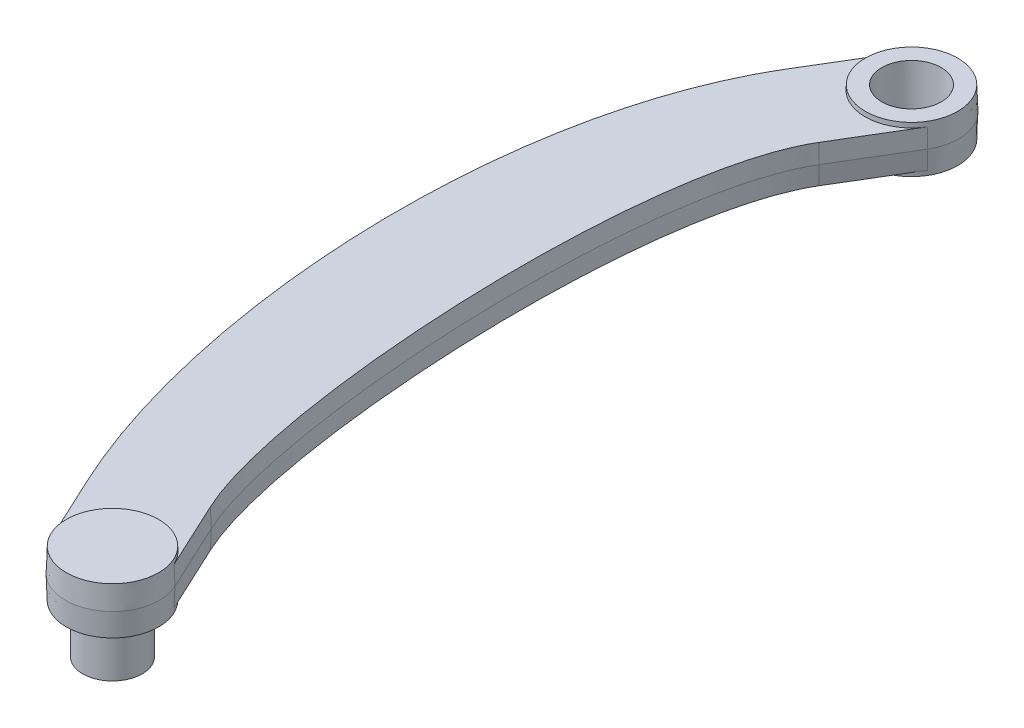
ISO-10303-21;
HEADER;
FILE_DESCRIPTION(('STEP AP214'),'2;1');
FILE_NAME('part.step','',(''),(''),'','','');
FILE_SCHEMA(('AUTOMOTIVE_DESIGN { 1 0 10303 214 1 1 1 1 }'));
ENDSEC;
DATA;
#1=APPLICATION_CONTEXT('core data for automotive mechanical design processes');
#2=APPLICATION_PROTOCOL_DEFINITION('international standard','automotive_design',2000,#1);
#3=PRODUCT_CONTEXT('',#1,'mechanical');
#4=PRODUCT('Part','Part','',(#3));
#5=PRODUCT_RELATED_PRODUCT_CATEGORY('part','',(#4));
#6=PRODUCT_DEFINITION_FORMATION('','',#4);
#7=PRODUCT_DEFINITION_CONTEXT('part definition',#1,'design');
#8=PRODUCT_DEFINITION('design','',#6,#7);
#9=PRODUCT_DEFINITION_SHAPE('','',#8);
#10=(LENGTH_UNIT() NAMED_UNIT(*) SI_UNIT(.MILLI.,.METRE.));
#11=(NAMED_UNIT(*) PLANE_ANGLE_UNIT() SI_UNIT($,.RADIAN.));
#12=(NAMED_UNIT(*) SI_UNIT($,.STERADIAN.) SOLID_ANGLE_UNIT());
#13=UNCERTAINTY_MEASURE_WITH_UNIT(LENGTH_MEASURE(1.E-05),#10,'distance_accuracy_value','');
#14=(GEOMETRIC_REPRESENTATION_CONTEXT(3) GLOBAL_UNCERTAINTY_ASSIGNED_CONTEXT((#13)) GLOBAL_UNIT_ASSIGNED_CONTEXT((#10,
#11,#12)) REPRESENTATION_CONTEXT('',''));
#15=CARTESIAN_POINT('',(0.,0.,0.));
#16=DIRECTION('',(0.,0.,1.));
#17=DIRECTION('',(1.,0.,0.));
#18=AXIS2_PLACEMENT_3D('',#15,#16,#17);
#19=CARTESIAN_POINT('',(27.4992695920869,171.,1604.79046254249));
#20=DIRECTION('',(0.,-1.,0.));
#21=DIRECTION('',(0.,0.,-1.));
#22=AXIS2_PLACEMENT_3D('',#19,#20,#21);
#23=PLANE('',#22);
#24=CARTESIAN_POINT('',(27.4992695920869,171.,1604.79046254249));
#25=DIRECTION('',(0.,1.,0.));
#26=DIRECTION('',(0.,0.,1.));
#27=AXIS2_PLACEMENT_3D('',#24,#25,#26);
#28=CIRCLE('',#27,49.1269807627063);
#29=CARTESIAN_POINT('',(27.4992695920869,171.,1653.9174433052));
#30=VERTEX_POINT('',#29);
#31=EDGE_CURVE('E52',#30,#30,#28,.T.);
#32=ORIENTED_EDGE('',*,*,#31,.F.);
#33=EDGE_LOOP('',(#32));
#34=FACE_BOUND('',#33,.T.);
#35=CARTESIAN_POINT('',(27.499269592087,171.,1604.79046254249));
#36=DIRECTION('',(0.,1.,0.));
#37=DIRECTION('',(0.,0.,-1.));
#38=AXIS2_PLACEMENT_3D('',#35,#36,#37);
#39=CIRCLE('',#38,31.620388964152);
#40=CARTESIAN_POINT('',(27.499269592087,171.,1573.17007357834));
#41=VERTEX_POINT('',#40);
#42=EDGE_CURVE('E11',#41,#41,#39,.T.);
#43=ORIENTED_EDGE('',*,*,#42,.T.);
#44=EDGE_LOOP('',(#43));
#45=FACE_BOUND('',#44,.T.);
#46=ADVANCED_FACE('F42',(#34,#45),#23,.T.);
#47=CARTESIAN_POINT('',(27.4992695920869,196.,1604.79046254249));
#48=DIRECTION('',(0.,1.,0.));
#49=DIRECTION('',(0.,0.,1.));
#50=AXIS2_PLACEMENT_3D('',#47,#48,#49);
#51=CONICAL_SURFACE('',#50,50.,0.0349065849999998);
#52=ORIENTED_EDGE('',*,*,#31,.T.);
#53=EDGE_LOOP('',(#52));
#54=FACE_BOUND('',#53,.T.);
#55=CARTESIAN_POINT('',(27.4992695920869,176.,1604.79046254249));
#56=DIRECTION('',(0.,-1.,0.));
#57=DIRECTION('',(0.,0.,-1.));
#58=AXIS2_PLACEMENT_3D('',#55,#56,#57);
#59=CIRCLE('',#58,49.3015846101651);
#60=CARTESIAN_POINT('',(-17.183140453352,176.,1625.62621253151));
#61=VERTEX_POINT('',#60);
#62=CARTESIAN_POINT('',(72.1816796375259,176.,1583.95471255349));
#63=VERTEX_POINT('',#62);
#64=EDGE_CURVE('E212',#61,#63,#59,.T.);
#65=ORIENTED_EDGE('',*,*,#64,.T.);
#66=DIRECTION('',(0.0316296856251365,0.999390827019096,-0.0147491646320362));
#67=VECTOR('',#66,1.);
#68=CARTESIAN_POINT('',(72.8146589439195,196.,1583.65954945546));
#69=LINE('',#68,#67);
#70=CARTESIAN_POINT('',(72.8146589439195,196.,1583.65954945546));
#71=VERTEX_POINT('',#70);
#72=EDGE_CURVE('E186',#63,#71,#69,.T.);
#73=ORIENTED_EDGE('',*,*,#72,.T.);
#74=CARTESIAN_POINT('',(27.4992695920869,196.,1604.79046254249));
#75=DIRECTION('',(0.,1.,0.));
#76=DIRECTION('',(-1.,0.,0.));
#77=AXIS2_PLACEMENT_3D('',#74,#75,#76);
#78=CIRCLE('',#77,50.);
#79=CARTESIAN_POINT('',(-17.8161197597457,196.,1625.92137562953));
#80=VERTEX_POINT('',#79);
#81=EDGE_CURVE('E211',#80,#71,#78,.T.);
#82=ORIENTED_EDGE('',*,*,#81,.F.);
#83=DIRECTION('',(-0.0316296856251366,0.999390827019096,0.0147491646320361));
#84=VECTOR('',#83,1.);
#85=CARTESIAN_POINT('',(-17.8161197597457,196.,1625.92137562953));
#86=LINE('',#85,#84);
#87=EDGE_CURVE('E231',#61,#80,#86,.T.);
#88=ORIENTED_EDGE('',*,*,#87,.F.);
#89=EDGE_LOOP('',(#65,#73,#82,#88));
#90=FACE_BOUND('',#89,.T.);
#91=ADVANCED_FACE('F355',(#54,#90),#51,.T.);
#92=CARTESIAN_POINT('',(27.4992695920869,196.,754.790462542496));
#93=DIRECTION('',(0.,1.,0.));
#94=DIRECTION('',(0.,0.,1.));
#95=AXIS2_PLACEMENT_3D('',#92,#93,#94);
#96=CONICAL_SURFACE('',#95,50.,0.0349065849999998);
#97=CARTESIAN_POINT('',(27.4992695920869,171.,754.790462542496));
#98=DIRECTION('',(0.,1.,0.));
#99=DIRECTION('',(0.,0.,1.));
#100=AXIS2_PLACEMENT_3D('',#97,#98,#99);
#101=CIRCLE('',#100,49.1269807627063);
#102=CARTESIAN_POINT('',(27.4992695920869,171.,803.917443305202));
#103=VERTEX_POINT('',#102);
#104=EDGE_CURVE('E218',#103,#103,#101,.T.);
#105=ORIENTED_EDGE('',*,*,#104,.T.);
#106=EDGE_LOOP('',(#105));
#107=FACE_BOUND('',#106,.T.);
#108=CARTESIAN_POINT('',(27.4992695920869,176.,754.790462542496));
#109=DIRECTION('',(0.,1.,0.));
#110=DIRECTION('',(0.,0.,-1.));
#111=AXIS2_PLACEMENT_3D('',#108,#109,#110);
#112=CIRCLE('',#111,49.3015846101651);
#113=CARTESIAN_POINT('',(-14.7276021401644,176.,729.34370344077));
#114=VERTEX_POINT('',#113);
#115=CARTESIAN_POINT('',(69.7261413243383,176.,780.237221644222));
#116=VERTEX_POINT('',#115);
#117=EDGE_CURVE('E266',#114,#116,#112,.T.);
#118=ORIENTED_EDGE('',*,*,#117,.F.);
#119=DIRECTION('',(-0.0298914645934684,0.999390827019096,-0.0180131955672863));
#120=VECTOR('',#119,1.);
#121=CARTESIAN_POINT('',(-15.3257958354703,196.,728.983219932611));
#122=LINE('',#121,#120);
#123=CARTESIAN_POINT('',(-15.3257958354703,196.,728.983219932611));
#124=VERTEX_POINT('',#123);
#125=EDGE_CURVE('E215',#114,#124,#122,.T.);
#126=ORIENTED_EDGE('',*,*,#125,.T.);
#127=CARTESIAN_POINT('',(27.4992695920869,196.,754.790462542496));
#128=DIRECTION('',(0.,1.,0.));
#129=DIRECTION('',(-1.,0.,0.));
#130=AXIS2_PLACEMENT_3D('',#127,#128,#129);
#131=CIRCLE('',#130,50.);
#132=CARTESIAN_POINT('',(70.3243350196442,196.,780.597705152381));
#133=VERTEX_POINT('',#132);
#134=EDGE_CURVE('E182',#133,#124,#131,.T.);
#135=ORIENTED_EDGE('',*,*,#134,.F.);
#136=DIRECTION('',(0.0298914645934685,0.999390827019096,0.0180131955672862));
#137=VECTOR('',#136,1.);
#138=CARTESIAN_POINT('',(70.3243350196442,196.,780.597705152381));
#139=LINE('',#138,#137);
#140=EDGE_CURVE('E206',#116,#133,#139,.T.);
#141=ORIENTED_EDGE('',*,*,#140,.F.);
#142=EDGE_LOOP('',(#118,#126,#135,#141));
#143=FACE_BOUND('',#142,.T.);
#144=ADVANCED_FACE('F360',(#107,#143),#96,.T.);
#145=CARTESIAN_POINT('',(-58.6473863609172,216.,800.871951972799));
#146=DIRECTION('',(0.,-1.,0.));
#147=DIRECTION('',(0.,0.,-1.));
#148=AXIS2_PLACEMENT_3D('',#145,#146,#147);
#149=PLANE('',#148);
#150=DIRECTION('',(0.516144852197692,0.,-0.856501308551145));
#151=VECTOR('',#150,1.);
#152=CARTESIAN_POINT('',(26.404550798892,216.,852.125953684408));
#153=LINE('',#152,#151);
#154=CARTESIAN_POINT('',(26.404550798892,216.,852.125953684408));
#155=VERTEX_POINT('',#154);
#156=CARTESIAN_POINT('',(69.7261413243383,216.,780.237221644222));
#157=VERTEX_POINT('',#156);
#158=EDGE_CURVE('E219',#155,#157,#153,.T.);
#159=ORIENTED_EDGE('',*,*,#158,.T.);
#160=CARTESIAN_POINT('',(27.4992695920869,216.,754.790462542496));
#161=DIRECTION('',(0.,-1.,0.));
#162=DIRECTION('',(0.,0.,-1.));
#163=AXIS2_PLACEMENT_3D('',#160,#161,#162);
#164=CIRCLE('',#163,49.3015846101651);
#165=CARTESIAN_POINT('',(-14.7276021401644,216.,729.34370344077));
#166=VERTEX_POINT('',#165);
#167=EDGE_CURVE('E234',#157,#166,#164,.T.);
#168=ORIENTED_EDGE('',*,*,#167,.T.);
#169=DIRECTION('',(0.516144852197694,0.,-0.856501308551143));
#170=VECTOR('',#169,1.);
#171=CARTESIAN_POINT('',(-58.0491926656104,216.,801.232435480956));
#172=LINE('',#171,#170);
#173=CARTESIAN_POINT('',(-58.0491926656065,216.,801.23243548095));
#174=VERTEX_POINT('',#173);
#175=EDGE_CURVE('E167',#174,#166,#172,.T.);
#176=ORIENTED_EDGE('',*,*,#175,.F.);
#177=CARTESIAN_POINT('',(-50.9926013926077,216.,1553.12158956858));
#178=CARTESIAN_POINT('',(-99.6075169547386,216.,1448.86656665861));
#179=CARTESIAN_POINT('',(-130.160683682177,216.,1308.60757191893));
#180=CARTESIAN_POINT('',(-136.145493314435,216.,1101.52811696768));
#181=CARTESIAN_POINT('',(-131.501101213798,216.,1033.05308228878));
#182=CARTESIAN_POINT('',(-106.829986650642,216.,906.761015585911));
#183=CARTESIAN_POINT('',(-86.8020403053043,216.,848.945498047769));
#184=CARTESIAN_POINT('',(-58.0491926656113,216.,801.232435480957));
#185=(BOUNDED_CURVE() B_SPLINE_CURVE(3,(#177,#178,#179,#180,#181,#182,#183,#184),.UNSPECIFIED.,
.F.,.F.) B_SPLINE_CURVE_WITH_KNOTS((4,2,2,4),(0.,0.5,0.75,1.),
.UNSPECIFIED.) CURVE() GEOMETRIC_REPRESENTATION_ITEM() RATIONAL_B_SPLINE_CURVE((1.,1.,1.,1.,1.,
1.,1.,1.)) REPRESENTATION_ITEM(''));
#186=CARTESIAN_POINT('',(-50.9926013926077,216.,1553.12158956858));
#187=VERTEX_POINT('',#186);
#188=EDGE_CURVE('E163',#187,#174,#185,.T.);
#189=ORIENTED_EDGE('',*,*,#188,.F.);
#190=DIRECTION('',(-0.422618261740698,0.,-0.906307787036651));
#191=VECTOR('',#190,1.);
#192=CARTESIAN_POINT('',(-245.982181757065,216.,1134.96508504974));
#193=LINE('',#192,#191);
#194=CARTESIAN_POINT('',(-17.183140453352,216.,1625.62621253151));
#195=VERTEX_POINT('',#194);
#196=EDGE_CURVE('E149',#195,#187,#193,.T.);
#197=ORIENTED_EDGE('',*,*,#196,.F.);
#198=CARTESIAN_POINT('',(27.4992695920869,216.,1604.79046254249));
#199=DIRECTION('',(0.,-1.,0.));
#200=DIRECTION('',(0.,0.,-1.));
#201=AXIS2_PLACEMENT_3D('',#198,#199,#200);
#202=CIRCLE('',#201,49.3015846101651);
#203=CARTESIAN_POINT('',(72.1816796375259,216.,1583.95471255349));
#204=VERTEX_POINT('',#203);
#205=EDGE_CURVE('E200',#195,#204,#202,.T.);
#206=ORIENTED_EDGE('',*,*,#205,.T.);
#207=DIRECTION('',(-0.4226182617407,0.,-0.90630778703665));
#208=VECTOR('',#207,1.);
#209=CARTESIAN_POINT('',(-216.056161898684,216.,965.826666626347));
#210=LINE('',#209,#208);
#211=CARTESIAN_POINT('',(38.3722186982618,216.,1511.45008959053));
#212=VERTEX_POINT('',#211);
#213=EDGE_CURVE('E194',#204,#212,#210,.T.);
#214=ORIENTED_EDGE('',*,*,#213,.T.);
#215=CARTESIAN_POINT('',(38.3722186982376,216.000000001021,1511.45008959057));
#216=CARTESIAN_POINT('',(23.2488258960947,215.999999995083,1479.01786906043));
#217=CARTESIAN_POINT('',(10.5186333608645,215.999999999373,1429.01611434538));
#218=CARTESIAN_POINT('',(-8.50011650459189,216.000000002669,1311.74890935448));
#219=CARTESIAN_POINT('',(-14.7805689403765,216.000000001021,1244.48660267816));
#220=CARTESIAN_POINT('',(-19.1292243495364,216.000000001021,1110.66682866679));
#221=CARTESIAN_POINT('',(-17.1978431593789,216.000000001021,1044.11157308509));
#222=CARTESIAN_POINT('',(-6.81405137152571,216.000000001021,958.274429016196));
#223=CARTESIAN_POINT('',(-2.10519993591273,216.000000001021,931.994599323943));
#224=CARTESIAN_POINT('',(10.0387086204824,216.000000001021,886.333015891249));
#225=CARTESIAN_POINT('',(17.4711845005632,216.000000001021,866.950164159603));
#226=CARTESIAN_POINT('',(26.4045507988615,216.000000001021,852.125953684389));
#227=(BOUNDED_CURVE() B_SPLINE_CURVE(3,(#215,#216,#217,#218,#219,#220,#221,#222,#223,#224,#225,
#226),.UNSPECIFIED.,.F.,.F.) B_SPLINE_CURVE_WITH_KNOTS((4,2,2,2,2,4),(0.,0.25,0.5,0.75,0.875,
1.),.UNSPECIFIED.) CURVE() GEOMETRIC_REPRESENTATION_ITEM() RATIONAL_B_SPLINE_CURVE((1.,1.,1.,1.,
1.,1.,1.,1.,1.,1.,1.,1.)) REPRESENTATION_ITEM(''));
#228=EDGE_CURVE('E201',#212,#155,#227,.T.);
#229=ORIENTED_EDGE('',*,*,#228,.T.);
#230=EDGE_LOOP('',(#159,#168,#176,#189,#197,#206,#214,#229));
#231=FACE_BOUND('',#230,.T.);
#232=ADVANCED_FACE('F165',(#231),#149,.F.);
#233=CARTESIAN_POINT('',(27.4992695920869,196.,1604.79046254249));
#234=DIRECTION('',(0.,-1.,0.));
#235=DIRECTION('',(0.,0.,1.));
#236=AXIS2_PLACEMENT_3D('',#233,#234,#235);
#237=CONICAL_SURFACE('',#236,50.,0.0349065849999998);
#238=CARTESIAN_POINT('',(27.4992695920869,221.,1604.79046254249));
#239=DIRECTION('',(0.,1.,0.));
#240=DIRECTION('',(0.,0.,1.));
#241=AXIS2_PLACEMENT_3D('',#238,#239,#240);
#242=CIRCLE('',#241,49.1269807627063);
#243=CARTESIAN_POINT('',(27.4992695920869,221.,1653.9174433052));
#244=VERTEX_POINT('',#243);
#245=EDGE_CURVE('E176',#244,#244,#242,.T.);
#246=ORIENTED_EDGE('',*,*,#245,.F.);
#247=EDGE_LOOP('',(#246));
#248=FACE_BOUND('',#247,.T.);
#249=DIRECTION('',(0.0316296856251365,-0.999390827019096,-0.0147491646320362));
#250=VECTOR('',#249,1.);
#251=CARTESIAN_POINT('',(72.8146589439195,196.,1583.65954945546));
#252=LINE('',#251,#250);
#253=EDGE_CURVE('E227',#204,#71,#252,.T.);
#254=ORIENTED_EDGE('',*,*,#253,.F.);
#255=ORIENTED_EDGE('',*,*,#205,.F.);
#256=DIRECTION('',(-0.0316296856251366,-0.999390827019096,0.0147491646320361));
#257=VECTOR('',#256,1.);
#258=CARTESIAN_POINT('',(-17.8161197597457,196.,1625.92137562953));
#259=LINE('',#258,#257);
#260=EDGE_CURVE('E156',#195,#80,#259,.T.);
#261=ORIENTED_EDGE('',*,*,#260,.T.);
#262=ORIENTED_EDGE('',*,*,#81,.T.);
#263=EDGE_LOOP('',(#254,#255,#261,#262));
#264=FACE_BOUND('',#263,.T.);
#265=ADVANCED_FACE('F349',(#248,#264),#237,.T.);
#266=CARTESIAN_POINT('',(-155.984382359794,196.,1092.99842197369));
#267=DIRECTION('',(0.905755688820404,0.0348994967025009,-0.42236081411441));
#268=DIRECTION('',(0.,-0.996603558665943,-0.0823489335351579));
#269=AXIS2_PLACEMENT_3D('',#266,#267,#268);
#270=PLANE('',#269);
#271=DIRECTION('',(-0.4226182617407,0.,-0.90630778703665));
#272=VECTOR('',#271,1.);
#273=CARTESIAN_POINT('',(-155.984382359794,196.,1092.99842197369));
#274=LINE('',#273,#272);
#275=CARTESIAN_POINT('',(39.0051980046635,196.,1511.15492649253));
#276=VERTEX_POINT('',#275);
#277=EDGE_CURVE('E224',#71,#276,#274,.T.);
#278=ORIENTED_EDGE('',*,*,#277,.T.);
#279=DIRECTION('',(0.0316296856255427,-0.999390827019096,-0.0147491646311678));
#280=VECTOR('',#279,1.);
#281=CARTESIAN_POINT('',(39.0051980046635,196.,1511.15492649253));
#282=LINE('',#281,#280);
#283=EDGE_CURVE('E222',#212,#276,#282,.T.);
#284=ORIENTED_EDGE('',*,*,#283,.F.);
#285=ORIENTED_EDGE('',*,*,#213,.F.);
#286=ORIENTED_EDGE('',*,*,#253,.T.);
#287=EDGE_LOOP('',(#278,#284,#285,#286));
#288=FACE_BOUND('',#287,.T.);
#289=ADVANCED_FACE('F44',(#288),#270,.T.);
#290=CARTESIAN_POINT('',(39.0051980046635,196.,1511.15492649253));
#291=CARTESIAN_POINT('',(23.9311171548756,195.99999999406,1478.82845578703));
#292=CARTESIAN_POINT('',(11.2023067598032,195.999999998352,1428.86894913812));
#293=CARTESIAN_POINT('',(-7.80497513454681,196.000000001648,1311.67245421368));
#294=CARTESIAN_POINT('',(-14.0834466405206,196.,1244.43546585474));
#295=CARTESIAN_POINT('',(-18.4302528220003,196.,1110.67259752409));
#296=CARTESIAN_POINT('',(-16.4985874978602,196.,1044.1467175382));
#297=CARTESIAN_POINT('',(-6.12363842827518,196.,958.382671400139));
#298=CARTESIAN_POINT('',(-1.41908022456142,196.,932.13211832246));
#299=CARTESIAN_POINT('',(10.7024946205448,196.,886.554510538051));
#300=CARTESIAN_POINT('',(18.1195112618451,196.,867.227455833705));
#301=CARTESIAN_POINT('',(27.002744494198,196.,852.486437192567));
#302=CARTESIAN_POINT('',(38.2456228369912,220.,1511.50912221016));
#303=CARTESIAN_POINT('',(23.1123676443803,219.999999994062,1479.0557517151));
#304=CARTESIAN_POINT('',(10.3818986811186,219.999999998353,1429.04554738682));
#305=CARTESIAN_POINT('',(-8.63914477855832,220.000000001648,1311.76420038263));
#306=CARTESIAN_POINT('',(-14.919993400305,220.,1244.49683004285));
#307=CARTESIAN_POINT('',(-19.2690186550009,220.,1110.66567489533));
#308=CARTESIAN_POINT('',(-17.3376942916398,220.,1044.10454419447));
#309=CARTESIAN_POINT('',(-6.95213396013353,220.,958.252780539414));
#310=CARTESIAN_POINT('',(-2.24242387814096,220.,931.967095524248));
#311=CARTESIAN_POINT('',(9.90595142051053,220.,886.288716961902));
#312=CARTESIAN_POINT('',(17.3415191483465,220.,866.8947058248));
#313=CARTESIAN_POINT('',(26.2849120598308,220.,852.053856982776));
#314=(BOUNDED_SURFACE() B_SPLINE_SURFACE(1,3,((#290,#291,#292,#293,#294,#295,#296,#297,#298,
#299,#300,#301),(#302,#303,#304,#305,#306,#307,#308,#309,#310,#311,#312,#313)),.UNSPECIFIED.,
.F.,.F.,.F.) B_SPLINE_SURFACE_WITH_KNOTS((2,2),(4,2,2,2,2,4),(0.,1.),(0.,0.25,0.5,0.75,0.875,
1.),.UNSPECIFIED.) GEOMETRIC_REPRESENTATION_ITEM() RATIONAL_B_SPLINE_SURFACE(((1.,1.,1.,1.,1.,
1.,1.,1.,1.,1.,1.,1.),(1.,1.,1.,1.,1.,1.,1.,1.,1.,1.,1.,1.))) REPRESENTATION_ITEM('') SURFACE());
#315=CARTESIAN_POINT('',(39.0051980046216,196.000000001326,1511.15492649255));
#316=CARTESIAN_POINT('',(23.9311171548304,195.999999995386,1478.82845578704));
#317=CARTESIAN_POINT('',(11.2023067597579,195.999999999678,1428.86894913813));
#318=CARTESIAN_POINT('',(-7.80497513459288,196.000000002974,1311.67245421369));
#319=CARTESIAN_POINT('',(-14.0834466405668,196.000000001326,1244.43546585474));
#320=CARTESIAN_POINT('',(-18.4302528220466,196.000000001326,1110.67259752409));
#321=CARTESIAN_POINT('',(-16.4985874979065,196.000000001326,1044.1467175382));
#322=CARTESIAN_POINT('',(-6.12363842832094,196.000000001326,958.382671400132));
#323=CARTESIAN_POINT('',(-1.41908022460689,196.000000001326,932.132118322451));
#324=CARTESIAN_POINT('',(10.7024946205008,196.000000001326,886.554510538036));
#325=CARTESIAN_POINT('',(18.1195112618021,196.000000001326,867.227455833687));
#326=CARTESIAN_POINT('',(27.0027444941583,196.000000001326,852.486437192543));
#327=(BOUNDED_CURVE() B_SPLINE_CURVE(3,(#315,#316,#317,#318,#319,#320,#321,#322,#323,#324,#325,
#326),.UNSPECIFIED.,.F.,.F.) B_SPLINE_CURVE_WITH_KNOTS((4,2,2,2,2,4),(0.,0.25,0.5,0.75,0.875,
1.),.UNSPECIFIED.) CURVE() GEOMETRIC_REPRESENTATION_ITEM() RATIONAL_B_SPLINE_CURVE((1.,1.,1.,1.,
1.,1.,1.,1.,1.,1.,1.,1.)) REPRESENTATION_ITEM(''));
#328=CARTESIAN_POINT('',(27.0027444941979,196.,852.486437192567));
#329=VERTEX_POINT('',#328);
#330=EDGE_CURVE('E269',#276,#329,#327,.T.);
#331=DIRECTION('',(0.0298914645934685,-0.999390827019096,0.0180131955672862));
#332=VECTOR('',#331,1.);
#333=CARTESIAN_POINT('',(27.0027444941979,196.,852.486437192567));
#334=LINE('',#333,#332);
#335=EDGE_CURVE('E203',#155,#329,#334,.T.);
#336=ORIENTED_EDGE('',*,*,#330,.T.);
#337=ORIENTED_EDGE('',*,*,#335,.F.);
#338=ORIENTED_EDGE('',*,*,#228,.F.);
#339=ORIENTED_EDGE('',*,*,#283,.T.);
#340=EDGE_LOOP('',(#336,#337,#338,#339));
#341=FACE_BOUND('',#340,.T.);
#342=ADVANCED_FACE('F340',(#341),#314,.F.);
#343=CARTESIAN_POINT('',(27.002744494198,196.,852.486437192567));
#344=DIRECTION('',(0.855979551095866,0.0348994967025009,0.5158304306995));
#345=DIRECTION('',(0.,-0.997719098351478,0.0675025983552802));
#346=AXIS2_PLACEMENT_3D('',#343,#344,#345);
#347=PLANE('',#346);
#348=DIRECTION('',(0.516144852197692,0.,-0.856501308551145));
#349=VECTOR('',#348,1.);
#350=CARTESIAN_POINT('',(27.002744494198,196.,852.486437192567));
#351=LINE('',#350,#349);
#352=EDGE_CURVE('E220',#329,#133,#351,.T.);
#353=ORIENTED_EDGE('',*,*,#352,.T.);
#354=DIRECTION('',(0.0298914645934685,-0.999390827019096,0.0180131955672862));
#355=VECTOR('',#354,1.);
#356=CARTESIAN_POINT('',(70.3243350196442,196.,780.597705152381));
#357=LINE('',#356,#355);
#358=EDGE_CURVE('E178',#157,#133,#357,.T.);
#359=ORIENTED_EDGE('',*,*,#358,.F.);
#360=ORIENTED_EDGE('',*,*,#158,.F.);
#361=ORIENTED_EDGE('',*,*,#335,.T.);
#362=EDGE_LOOP('',(#353,#359,#360,#361));
#363=FACE_BOUND('',#362,.T.);
#364=ADVANCED_FACE('F338',(#363),#347,.T.);
#365=CARTESIAN_POINT('',(-58.6473863609163,196.,800.871951972797));
#366=DIRECTION('',(-0.855979551095865,0.0348994967025009,-0.515830430699502));
#367=DIRECTION('',(-0.516144852197694,0.,0.856501308551144));
#368=AXIS2_PLACEMENT_3D('',#365,#366,#367);
#369=PLANE('',#368);
#370=DIRECTION('',(0.516144852197694,0.,-0.856501308551143));
#371=VECTOR('',#370,1.);
#372=CARTESIAN_POINT('',(-58.6473863609163,196.,800.871951972797));
#373=LINE('',#372,#371);
#374=CARTESIAN_POINT('',(-58.6473863609172,196.,800.871951972799));
#375=VERTEX_POINT('',#374);
#376=EDGE_CURVE('E209',#375,#124,#373,.T.);
#377=ORIENTED_EDGE('',*,*,#376,.F.);
#378=DIRECTION('',(-0.0298914645937054,-0.999390827019096,-0.018013195566893));
#379=VECTOR('',#378,1.);
#380=CARTESIAN_POINT('',(-58.6473863609172,196.,800.871951972799));
#381=LINE('',#380,#379);
#382=EDGE_CURVE('E160',#174,#375,#381,.T.);
#383=ORIENTED_EDGE('',*,*,#382,.F.);
#384=ORIENTED_EDGE('',*,*,#175,.T.);
#385=DIRECTION('',(-0.0298914645934684,-0.999390827019096,-0.0180131955672863));
#386=VECTOR('',#385,1.);
#387=CARTESIAN_POINT('',(-15.3257958354703,196.,728.983219932611));
#388=LINE('',#387,#386);
#389=EDGE_CURVE('E171',#166,#124,#388,.T.);
#390=ORIENTED_EDGE('',*,*,#389,.T.);
#391=EDGE_LOOP('',(#377,#383,#384,#390));
#392=FACE_BOUND('',#391,.T.);
#393=ADVANCED_FACE('F347',(#392),#369,.T.);
#394=CARTESIAN_POINT('',(-51.6255806990014,196.,1553.4167526666));
#395=CARTESIAN_POINT('',(-100.29304430923,196.,1449.04904011446));
#396=CARTESIAN_POINT('',(-130.856228678564,196.,1308.7169803077));
#397=CARTESIAN_POINT('',(-136.844906651055,196.,1101.50367752298));
#398=CARTESIAN_POINT('',(-132.198449546245,196.,1032.98004107741));
#399=CARTESIAN_POINT('',(-107.503555872256,196.,906.566248494571));
#400=CARTESIAN_POINT('',(-87.4551192997827,196.,848.676092330308));
#401=CARTESIAN_POINT('',(-58.6473863609172,196.,800.871951972799));
#402=CARTESIAN_POINT('',(-50.866005531329,220.,1553.06255694897));
#403=CARTESIAN_POINT('',(-99.4704114838403,220.,1448.83007196744));
#404=CARTESIAN_POINT('',(-130.0215746829,220.,1308.58569024118));
#405=CARTESIAN_POINT('',(-136.005610647111,220.,1101.53300485662));
#406=CARTESIAN_POINT('',(-131.361631547308,220.,1033.06769053105));
#407=CARTESIAN_POINT('',(-106.695272806319,220.,906.799969004179));
#408=CARTESIAN_POINT('',(-86.6714245064086,220.,848.999379191261));
#409=CARTESIAN_POINT('',(-57.9295539265501,220.,801.304532182589));
#410=(BOUNDED_SURFACE() B_SPLINE_SURFACE(1,3,((#394,#395,#396,#397,#398,#399,#400,#401),(#402,
#403,#404,#405,#406,#407,#408,#409)),.UNSPECIFIED.,.F.,.F.,.F.) B_SPLINE_SURFACE_WITH_KNOTS((2,
2),(4,2,2,4),(0.,1.),(0.,0.5,0.75,1.),
.UNSPECIFIED.) GEOMETRIC_REPRESENTATION_ITEM() RATIONAL_B_SPLINE_SURFACE(((1.,1.,1.,1.,1.,1.,1.,
1.),(1.,1.,1.,1.,1.,1.,1.,1.))) REPRESENTATION_ITEM('') SURFACE());
#411=CARTESIAN_POINT('',(-51.6255806990017,195.999999999991,1553.4167526666));
#412=CARTESIAN_POINT('',(-100.293044309231,195.999999999991,1449.04904011446));
#413=CARTESIAN_POINT('',(-130.856228678564,195.999999999991,1308.7169803077));
#414=CARTESIAN_POINT('',(-136.844906651055,195.999999999991,1101.50367752298));
#415=CARTESIAN_POINT('',(-132.198449546245,195.999999999991,1032.98004107741));
#416=CARTESIAN_POINT('',(-107.503555872257,195.999999999991,906.566248494571));
#417=CARTESIAN_POINT('',(-87.455119299783,195.999999999991,848.676092330308));
#418=CARTESIAN_POINT('',(-58.6473863609175,195.999999999991,800.871951972799));
#419=(BOUNDED_CURVE() B_SPLINE_CURVE(3,(#411,#412,#413,#414,#415,#416,#417,#418),.UNSPECIFIED.,
.F.,.F.) B_SPLINE_CURVE_WITH_KNOTS((4,2,2,4),(0.,0.5,0.75,1.),
.UNSPECIFIED.) CURVE() GEOMETRIC_REPRESENTATION_ITEM() RATIONAL_B_SPLINE_CURVE((1.,1.,1.,1.,1.,
1.,1.,1.)) REPRESENTATION_ITEM(''));
#420=CARTESIAN_POINT('',(-51.6255806990014,196.,1553.4167526666));
#421=VERTEX_POINT('',#420);
#422=EDGE_CURVE('E175',#421,#375,#419,.T.);
#423=DIRECTION('',(-0.0316296856251366,-0.999390827019096,0.0147491646320362));
#424=VECTOR('',#423,1.);
#425=CARTESIAN_POINT('',(-51.6255806990014,196.,1553.4167526666));
#426=LINE('',#425,#424);
#427=EDGE_CURVE('E46',#187,#421,#426,.T.);
#428=ORIENTED_EDGE('',*,*,#422,.F.);
#429=ORIENTED_EDGE('',*,*,#427,.F.);
#430=ORIENTED_EDGE('',*,*,#188,.T.);
#431=ORIENTED_EDGE('',*,*,#382,.T.);
#432=EDGE_LOOP('',(#428,#429,#430,#431));
#433=FACE_BOUND('',#432,.T.);
#434=ADVANCED_FACE('F174',(#433),#410,.T.);
#435=CARTESIAN_POINT('',(-246.615161063459,196.,1135.26024814776));
#436=DIRECTION('',(-0.905755688820405,0.0348994967025009,0.422360814114409));
#437=DIRECTION('',(0.0385022359177146,0.999258514013935,0.));
#438=AXIS2_PLACEMENT_3D('',#435,#436,#437);
#439=PLANE('',#438);
#440=DIRECTION('',(-0.422618261740698,0.,-0.906307787036651));
#441=VECTOR('',#440,1.);
#442=CARTESIAN_POINT('',(-246.615161063459,196.,1135.26024814776));
#443=LINE('',#442,#441);
#444=EDGE_CURVE('E190',#80,#421,#443,.T.);
#445=ORIENTED_EDGE('',*,*,#444,.F.);
#446=ORIENTED_EDGE('',*,*,#260,.F.);
#447=ORIENTED_EDGE('',*,*,#196,.T.);
#448=ORIENTED_EDGE('',*,*,#427,.T.);
#449=EDGE_LOOP('',(#445,#446,#447,#448));
#450=FACE_BOUND('',#449,.T.);
#451=ADVANCED_FACE('F152',(#450),#439,.T.);
#452=CARTESIAN_POINT('',(27.4992695920869,221.,1604.79046254249));
#453=DIRECTION('',(0.,1.,0.));
#454=DIRECTION('',(1.,0.,0.));
#455=AXIS2_PLACEMENT_3D('',#452,#453,#454);
#456=PLANE('',#455);
#457=ORIENTED_EDGE('',*,*,#245,.T.);
#458=EDGE_LOOP('',(#457));
#459=FACE_BOUND('',#458,.T.);
#460=ADVANCED_FACE('F425',(#459),#456,.T.);
#461=CARTESIAN_POINT('',(27.4992695920869,196.,754.790462542496));
#462=DIRECTION('',(0.,-1.,0.));
#463=DIRECTION('',(0.,0.,1.));
#464=AXIS2_PLACEMENT_3D('',#461,#462,#463);
#465=CONICAL_SURFACE('',#464,50.,0.0349065849999998);
#466=ORIENTED_EDGE('',*,*,#167,.F.);
#467=ORIENTED_EDGE('',*,*,#358,.T.);
#468=ORIENTED_EDGE('',*,*,#134,.T.);
#469=ORIENTED_EDGE('',*,*,#389,.F.);
#470=EDGE_LOOP('',(#466,#467,#468,#469));
#471=FACE_BOUND('',#470,.T.);
#472=CARTESIAN_POINT('',(27.4992695920869,221.,754.790462542496));
#473=DIRECTION('',(0.,1.,0.));
#474=DIRECTION('',(0.,0.,1.));
#475=AXIS2_PLACEMENT_3D('',#472,#473,#474);
#476=CIRCLE('',#475,49.1269807627063);
#477=CARTESIAN_POINT('',(27.4992695920869,221.,803.917443305202));
#478=VERTEX_POINT('',#477);
#479=EDGE_CURVE('E244',#478,#478,#476,.T.);
#480=ORIENTED_EDGE('',*,*,#479,.F.);
#481=EDGE_LOOP('',(#480));
#482=FACE_BOUND('',#481,.T.);
#483=ADVANCED_FACE('F393',(#471,#482),#465,.T.);
#484=CARTESIAN_POINT('',(27.4992695920869,221.,754.790462542496));
#485=DIRECTION('',(0.,1.,0.));
#486=DIRECTION('',(1.,0.,0.));
#487=AXIS2_PLACEMENT_3D('',#484,#485,#486);
#488=PLANE('',#487);
#489=CARTESIAN_POINT('',(27.4992695920868,221.,754.790462542496));
#490=DIRECTION('',(0.,-1.,0.));
#491=DIRECTION('',(0.,0.,1.));
#492=AXIS2_PLACEMENT_3D('',#489,#490,#491);
#493=CIRCLE('',#492,31.620388964152);
#494=CARTESIAN_POINT('',(27.4992695920868,221.,786.410851506648));
#495=VERTEX_POINT('',#494);
#496=EDGE_CURVE('E241',#495,#495,#493,.T.);
#497=ORIENTED_EDGE('',*,*,#496,.T.);
#498=EDGE_LOOP('',(#497));
#499=FACE_BOUND('',#498,.T.);
#500=ORIENTED_EDGE('',*,*,#479,.T.);
#501=EDGE_LOOP('',(#500));
#502=FACE_BOUND('',#501,.T.);
#503=ADVANCED_FACE('F390',(#499,#502),#488,.T.);
#504=CARTESIAN_POINT('',(-58.6473863609172,176.,800.871951972799));
#505=DIRECTION('',(0.,1.,0.));
#506=DIRECTION('',(1.,0.,0.));
#507=AXIS2_PLACEMENT_3D('',#504,#505,#506);
#508=PLANE('',#507);
#509=DIRECTION('',(0.516144852197694,0.,-0.856501308551143));
#510=VECTOR('',#509,1.);
#511=CARTESIAN_POINT('',(-58.0491926656104,176.,801.232435480956));
#512=LINE('',#511,#510);
#513=CARTESIAN_POINT('',(-58.0491926656065,176.,801.23243548095));
#514=VERTEX_POINT('',#513);
#515=EDGE_CURVE('E268',#514,#114,#512,.T.);
#516=ORIENTED_EDGE('',*,*,#515,.T.);
#517=ORIENTED_EDGE('',*,*,#117,.T.);
#518=DIRECTION('',(0.516144852197692,0.,-0.856501308551145));
#519=VECTOR('',#518,1.);
#520=CARTESIAN_POINT('',(26.404550798892,176.,852.125953684408));
#521=LINE('',#520,#519);
#522=CARTESIAN_POINT('',(26.404550798892,176.,852.125953684408));
#523=VERTEX_POINT('',#522);
#524=EDGE_CURVE('E208',#523,#116,#521,.T.);
#525=ORIENTED_EDGE('',*,*,#524,.F.);
#526=CARTESIAN_POINT('',(38.3722186982376,175.999999998979,1511.45008959057));
#527=CARTESIAN_POINT('',(23.2488258960947,176.000000004917,1479.01786906043));
#528=CARTESIAN_POINT('',(10.5186333608645,176.000000000627,1429.01611434538));
#529=CARTESIAN_POINT('',(-8.5001165045919,175.999999997331,1311.74890935448));
#530=CARTESIAN_POINT('',(-14.7805689403765,175.999999998979,1244.48660267816));
#531=CARTESIAN_POINT('',(-19.1292243495365,175.999999998979,1110.66682866679));
#532=CARTESIAN_POINT('',(-17.1978431593789,175.999999998979,1044.11157308509));
#533=CARTESIAN_POINT('',(-6.81405137152573,175.999999998979,958.274429016196));
#534=CARTESIAN_POINT('',(-2.10519993591274,175.999999998979,931.994599323943));
#535=CARTESIAN_POINT('',(10.0387086204824,175.999999998979,886.333015891249));
#536=CARTESIAN_POINT('',(17.4711845005632,175.999999998979,866.950164159603));
#537=CARTESIAN_POINT('',(26.4045507988615,175.999999998979,852.12595368439));
#538=(BOUNDED_CURVE() B_SPLINE_CURVE(3,(#526,#527,#528,#529,#530,#531,#532,#533,#534,#535,#536,
#537),.UNSPECIFIED.,.F.,.F.) B_SPLINE_CURVE_WITH_KNOTS((4,2,2,2,2,4),(0.,0.25,0.5,0.75,0.875,
1.),.UNSPECIFIED.) CURVE() GEOMETRIC_REPRESENTATION_ITEM() RATIONAL_B_SPLINE_CURVE((1.,1.,1.,1.,
1.,1.,1.,1.,1.,1.,1.,1.)) REPRESENTATION_ITEM(''));
#539=CARTESIAN_POINT('',(38.3722186982618,176.,1511.45008959053));
#540=VERTEX_POINT('',#539);
#541=EDGE_CURVE('E265',#540,#523,#538,.T.);
#542=ORIENTED_EDGE('',*,*,#541,.F.);
#543=DIRECTION('',(-0.4226182617407,0.,-0.90630778703665));
#544=VECTOR('',#543,1.);
#545=CARTESIAN_POINT('',(-216.056161898684,176.,965.826666626347));
#546=LINE('',#545,#544);
#547=EDGE_CURVE('E249',#63,#540,#546,.T.);
#548=ORIENTED_EDGE('',*,*,#547,.F.);
#549=ORIENTED_EDGE('',*,*,#64,.F.);
#550=DIRECTION('',(-0.422618261740698,0.,-0.906307787036651));
#551=VECTOR('',#550,1.);
#552=CARTESIAN_POINT('',(-245.982181757065,176.,1134.96508504974));
#553=LINE('',#552,#551);
#554=CARTESIAN_POINT('',(-50.9926013926077,176.,1553.12158956858));
#555=VERTEX_POINT('',#554);
#556=EDGE_CURVE('E248',#61,#555,#553,.T.);
#557=ORIENTED_EDGE('',*,*,#556,.T.);
#558=CARTESIAN_POINT('',(-50.9926013926077,176.,1553.12158956858));
#559=CARTESIAN_POINT('',(-99.6075169547386,176.,1448.86656665861));
#560=CARTESIAN_POINT('',(-130.160683682177,176.,1308.60757191893));
#561=CARTESIAN_POINT('',(-136.145493314435,176.,1101.52811696768));
#562=CARTESIAN_POINT('',(-131.501101213798,176.,1033.05308228878));
#563=CARTESIAN_POINT('',(-106.829986650642,176.,906.761015585911));
#564=CARTESIAN_POINT('',(-86.8020403053043,176.,848.945498047769));
#565=CARTESIAN_POINT('',(-58.0491926656113,176.,801.232435480957));
#566=(BOUNDED_CURVE() B_SPLINE_CURVE(3,(#558,#559,#560,#561,#562,#563,#564,#565),.UNSPECIFIED.,
.F.,.F.) B_SPLINE_CURVE_WITH_KNOTS((4,2,2,4),(0.,0.5,0.75,1.),
.UNSPECIFIED.) CURVE() GEOMETRIC_REPRESENTATION_ITEM() RATIONAL_B_SPLINE_CURVE((1.,1.,1.,1.,1.,
1.,1.,1.)) REPRESENTATION_ITEM(''));
#567=EDGE_CURVE('E245',#555,#514,#566,.T.);
#568=ORIENTED_EDGE('',*,*,#567,.T.);
#569=EDGE_LOOP('',(#516,#517,#525,#542,#548,#549,#557,#568));
#570=FACE_BOUND('',#569,.T.);
#571=ADVANCED_FACE('F305',(#570),#508,.F.);
#572=CARTESIAN_POINT('',(-155.984382359794,196.,1092.99842197369));
#573=DIRECTION('',(0.905755688820404,-0.0348994967025009,-0.42236081411441));
#574=DIRECTION('',(0.,-0.996603558665943,0.0823489335351579));
#575=AXIS2_PLACEMENT_3D('',#572,#573,#574);
#576=PLANE('',#575);
#577=ORIENTED_EDGE('',*,*,#277,.F.);
#578=ORIENTED_EDGE('',*,*,#72,.F.);
#579=ORIENTED_EDGE('',*,*,#547,.T.);
#580=DIRECTION('',(0.0316296856255427,0.999390827019096,-0.0147491646311678));
#581=VECTOR('',#580,1.);
#582=CARTESIAN_POINT('',(39.0051980046635,196.,1511.15492649253));
#583=LINE('',#582,#581);
#584=EDGE_CURVE('E262',#540,#276,#583,.T.);
#585=ORIENTED_EDGE('',*,*,#584,.T.);
#586=EDGE_LOOP('',(#577,#578,#579,#585));
#587=FACE_BOUND('',#586,.T.);
#588=ADVANCED_FACE('F441',(#587),#576,.T.);
#589=CARTESIAN_POINT('',(39.0051980046635,196.,1511.15492649253));
#590=CARTESIAN_POINT('',(23.9311171548756,196.00000000594,1478.82845578703));
#591=CARTESIAN_POINT('',(11.2023067598032,196.000000001648,1428.86894913812));
#592=CARTESIAN_POINT('',(-7.80497513454681,195.999999998352,1311.67245421368));
#593=CARTESIAN_POINT('',(-14.0834466405206,196.,1244.43546585474));
#594=CARTESIAN_POINT('',(-18.4302528220003,196.,1110.67259752409));
#595=CARTESIAN_POINT('',(-16.4985874978602,196.,1044.1467175382));
#596=CARTESIAN_POINT('',(-6.12363842827518,196.,958.382671400139));
#597=CARTESIAN_POINT('',(-1.41908022456142,196.,932.13211832246));
#598=CARTESIAN_POINT('',(10.7024946205448,196.,886.554510538051));
#599=CARTESIAN_POINT('',(18.1195112618451,196.,867.227455833705));
#600=CARTESIAN_POINT('',(27.002744494198,196.,852.486437192567));
#601=CARTESIAN_POINT('',(38.2456228369912,172.,1511.50912221016));
#602=CARTESIAN_POINT('',(23.1123676443803,172.000000005938,1479.0557517151));
#603=CARTESIAN_POINT('',(10.3818986811186,172.000000001648,1429.04554738682));
#604=CARTESIAN_POINT('',(-8.63914477855832,171.999999998353,1311.76420038263));
#605=CARTESIAN_POINT('',(-14.919993400305,172.,1244.49683004285));
#606=CARTESIAN_POINT('',(-19.2690186550009,172.,1110.66567489533));
#607=CARTESIAN_POINT('',(-17.3376942916398,172.,1044.10454419447));
#608=CARTESIAN_POINT('',(-6.95213396013353,172.,958.252780539414));
#609=CARTESIAN_POINT('',(-2.24242387814096,172.,931.967095524248));
#610=CARTESIAN_POINT('',(9.90595142051053,172.,886.288716961902));
#611=CARTESIAN_POINT('',(17.3415191483465,172.,866.8947058248));
#612=CARTESIAN_POINT('',(26.2849120598308,172.,852.053856982776));
#613=(BOUNDED_SURFACE() B_SPLINE_SURFACE(1,3,((#589,#590,#591,#592,#593,#594,#595,#596,#597,
#598,#599,#600),(#601,#602,#603,#604,#605,#606,#607,#608,#609,#610,#611,#612)),.UNSPECIFIED.,
.F.,.F.,.F.) B_SPLINE_SURFACE_WITH_KNOTS((2,2),(4,2,2,2,2,4),(0.,1.),(0.,0.25,0.5,0.75,0.875,
1.),.UNSPECIFIED.) GEOMETRIC_REPRESENTATION_ITEM() RATIONAL_B_SPLINE_SURFACE(((1.,1.,1.,1.,1.,
1.,1.,1.,1.,1.,1.,1.),(1.,1.,1.,1.,1.,1.,1.,1.,1.,1.,1.,1.))) REPRESENTATION_ITEM('') SURFACE());
#614=DIRECTION('',(0.0298914645934685,0.999390827019096,0.0180131955672862));
#615=VECTOR('',#614,1.);
#616=CARTESIAN_POINT('',(27.0027444941979,196.,852.486437192567));
#617=LINE('',#616,#615);
#618=EDGE_CURVE('E238',#523,#329,#617,.T.);
#619=ORIENTED_EDGE('',*,*,#330,.F.);
#620=ORIENTED_EDGE('',*,*,#584,.F.);
#621=ORIENTED_EDGE('',*,*,#541,.T.);
#622=ORIENTED_EDGE('',*,*,#618,.T.);
#623=EDGE_LOOP('',(#619,#620,#621,#622));
#624=FACE_BOUND('',#623,.T.);
#625=ADVANCED_FACE('F374',(#624),#613,.T.);
#626=CARTESIAN_POINT('',(27.002744494198,196.,852.486437192567));
#627=DIRECTION('',(0.855979551095866,-0.0348994967025009,0.5158304306995));
#628=DIRECTION('',(0.,-0.997719098351478,-0.0675025983552802));
#629=AXIS2_PLACEMENT_3D('',#626,#627,#628);
#630=PLANE('',#629);
#631=ORIENTED_EDGE('',*,*,#352,.F.);
#632=ORIENTED_EDGE('',*,*,#618,.F.);
#633=ORIENTED_EDGE('',*,*,#524,.T.);
#634=ORIENTED_EDGE('',*,*,#140,.T.);
#635=EDGE_LOOP('',(#631,#632,#633,#634));
#636=FACE_BOUND('',#635,.T.);
#637=ADVANCED_FACE('F370',(#636),#630,.T.);
#638=CARTESIAN_POINT('',(-58.6473863609163,196.,800.871951972797));
#639=DIRECTION('',(-0.855979551095865,-0.0348994967025009,-0.515830430699502));
#640=DIRECTION('',(-0.516144852197694,0.,0.856501308551144));
#641=AXIS2_PLACEMENT_3D('',#638,#639,#640);
#642=PLANE('',#641);
#643=ORIENTED_EDGE('',*,*,#376,.T.);
#644=ORIENTED_EDGE('',*,*,#125,.F.);
#645=ORIENTED_EDGE('',*,*,#515,.F.);
#646=DIRECTION('',(-0.0298914645937054,0.999390827019096,-0.018013195566893));
#647=VECTOR('',#646,1.);
#648=CARTESIAN_POINT('',(-58.6473863609172,196.,800.871951972799));
#649=LINE('',#648,#647);
#650=EDGE_CURVE('E284',#514,#375,#649,.T.);
#651=ORIENTED_EDGE('',*,*,#650,.T.);
#652=EDGE_LOOP('',(#643,#644,#645,#651));
#653=FACE_BOUND('',#652,.T.);
#654=ADVANCED_FACE('F373',(#653),#642,.T.);
#655=CARTESIAN_POINT('',(-51.6255806990014,196.,1553.4167526666));
#656=CARTESIAN_POINT('',(-100.29304430923,196.,1449.04904011446));
#657=CARTESIAN_POINT('',(-130.856228678564,196.,1308.7169803077));
#658=CARTESIAN_POINT('',(-136.844906651055,196.,1101.50367752298));
#659=CARTESIAN_POINT('',(-132.198449546245,196.,1032.98004107741));
#660=CARTESIAN_POINT('',(-107.503555872256,196.,906.566248494571));
#661=CARTESIAN_POINT('',(-87.4551192997827,196.,848.676092330308));
#662=CARTESIAN_POINT('',(-58.6473863609172,196.,800.871951972799));
#663=CARTESIAN_POINT('',(-50.866005531329,172.,1553.06255694897));
#664=CARTESIAN_POINT('',(-99.4704114838403,172.,1448.83007196744));
#665=CARTESIAN_POINT('',(-130.0215746829,172.,1308.58569024118));
#666=CARTESIAN_POINT('',(-136.005610647111,172.,1101.53300485662));
#667=CARTESIAN_POINT('',(-131.361631547308,172.,1033.06769053105));
#668=CARTESIAN_POINT('',(-106.695272806319,172.,906.799969004179));
#669=CARTESIAN_POINT('',(-86.6714245064086,172.,848.999379191261));
#670=CARTESIAN_POINT('',(-57.9295539265501,172.,801.304532182589));
#671=(BOUNDED_SURFACE() B_SPLINE_SURFACE(1,3,((#655,#656,#657,#658,#659,#660,#661,#662),(#663,
#664,#665,#666,#667,#668,#669,#670)),.UNSPECIFIED.,.F.,.F.,.F.) B_SPLINE_SURFACE_WITH_KNOTS((2,
2),(4,2,2,4),(0.,1.),(0.,0.5,0.75,1.),
.UNSPECIFIED.) GEOMETRIC_REPRESENTATION_ITEM() RATIONAL_B_SPLINE_SURFACE(((1.,1.,1.,1.,1.,1.,1.,
1.),(1.,1.,1.,1.,1.,1.,1.,1.))) REPRESENTATION_ITEM('') SURFACE());
#672=DIRECTION('',(-0.0316296856251366,0.999390827019096,0.0147491646320362));
#673=VECTOR('',#672,1.);
#674=CARTESIAN_POINT('',(-51.6255806990014,196.,1553.4167526666));
#675=LINE('',#674,#673);
#676=EDGE_CURVE('E189',#555,#421,#675,.T.);
#677=ORIENTED_EDGE('',*,*,#422,.T.);
#678=ORIENTED_EDGE('',*,*,#650,.F.);
#679=ORIENTED_EDGE('',*,*,#567,.F.);
#680=ORIENTED_EDGE('',*,*,#676,.T.);
#681=EDGE_LOOP('',(#677,#678,#679,#680));
#682=FACE_BOUND('',#681,.T.);
#683=ADVANCED_FACE('F311',(#682),#671,.F.);
#684=CARTESIAN_POINT('',(-246.615161063459,196.,1135.26024814776));
#685=DIRECTION('',(-0.905755688820405,-0.0348994967025009,0.422360814114409));
#686=DIRECTION('',(-0.0385022359177146,0.999258514013935,0.));
#687=AXIS2_PLACEMENT_3D('',#684,#685,#686);
#688=PLANE('',#687);
#689=ORIENTED_EDGE('',*,*,#444,.T.);
#690=ORIENTED_EDGE('',*,*,#676,.F.);
#691=ORIENTED_EDGE('',*,*,#556,.F.);
#692=ORIENTED_EDGE('',*,*,#87,.T.);
#693=EDGE_LOOP('',(#689,#690,#691,#692));
#694=FACE_BOUND('',#693,.T.);
#695=ADVANCED_FACE('F309',(#694),#688,.T.);
#696=CARTESIAN_POINT('',(27.4992695920869,171.,754.790462542496));
#697=DIRECTION('',(0.,-1.,0.));
#698=DIRECTION('',(0.,0.,-1.));
#699=AXIS2_PLACEMENT_3D('',#696,#697,#698);
#700=PLANE('',#699);
#701=CARTESIAN_POINT('',(27.4992695920868,171.,754.790462542496));
#702=DIRECTION('',(0.,-1.,0.));
#703=DIRECTION('',(0.,0.,-1.));
#704=AXIS2_PLACEMENT_3D('',#701,#702,#703);
#705=CIRCLE('',#704,29.);
#706=CARTESIAN_POINT('',(27.4992695920868,171.,725.790462542496));
#707=VERTEX_POINT('',#706);
#708=EDGE_CURVE('E228',#707,#707,#705,.T.);
#709=ORIENTED_EDGE('',*,*,#708,.F.);
#710=EDGE_LOOP('',(#709));
#711=FACE_BOUND('',#710,.T.);
#712=ORIENTED_EDGE('',*,*,#104,.F.);
#713=EDGE_LOOP('',(#712));
#714=FACE_BOUND('',#713,.T.);
#715=ADVANCED_FACE('F387',(#711,#714),#700,.T.);
#716=CARTESIAN_POINT('',(27.4992695920868,171.,754.790462542496));
#717=DIRECTION('',(0.,1.,0.));
#718=DIRECTION('',(0.,0.,1.));
#719=AXIS2_PLACEMENT_3D('',#716,#717,#718);
#720=CONICAL_SURFACE('',#719,29.,0.0523598775000005);
#721=ORIENTED_EDGE('',*,*,#708,.T.);
#722=EDGE_LOOP('',(#721));
#723=FACE_BOUND('',#722,.T.);
#724=ORIENTED_EDGE('',*,*,#496,.F.);
#725=EDGE_LOOP('',(#724));
#726=FACE_BOUND('',#725,.T.);
#727=ADVANCED_FACE('F404',(#723,#726),#720,.F.);
#728=CARTESIAN_POINT('',(27.499269592087,119.,1604.79046254249));
#729=DIRECTION('',(0.,1.,0.));
#730=DIRECTION('',(0.,0.,1.));
#731=AXIS2_PLACEMENT_3D('',#728,#729,#730);
#732=CYLINDRICAL_SURFACE('',#731,31.620388964152);
#733=ORIENTED_EDGE('',*,*,#42,.F.);
#734=EDGE_LOOP('',(#733));
#735=FACE_BOUND('',#734,.T.);
#736=CARTESIAN_POINT('',(27.499269592087,119.,1604.79046254249));
#737=DIRECTION('',(0.,-1.,0.));
#738=DIRECTION('',(0.,0.,1.));
#739=AXIS2_PLACEMENT_3D('',#736,#737,#738);
#740=CIRCLE('',#739,31.620388964152);
#741=CARTESIAN_POINT('',(27.499269592087,119.,1636.41085150665));
#742=VERTEX_POINT('',#741);
#743=EDGE_CURVE('E232',#742,#742,#740,.T.);
#744=ORIENTED_EDGE('',*,*,#743,.F.);
#745=EDGE_LOOP('',(#744));
#746=FACE_BOUND('',#745,.T.);
#747=ADVANCED_FACE('F409',(#735,#746),#732,.T.);
#748=CARTESIAN_POINT('',(27.499269592087,119.,1604.79046254249));
#749=DIRECTION('',(0.,-1.,0.));
#750=DIRECTION('',(0.,0.,-1.));
#751=AXIS2_PLACEMENT_3D('',#748,#749,#750);
#752=PLANE('',#751);
#753=ORIENTED_EDGE('',*,*,#743,.T.);
#754=EDGE_LOOP('',(#753));
#755=FACE_BOUND('',#754,.T.);
#756=ADVANCED_FACE('F448',(#755),#752,.T.);
#757=CLOSED_SHELL('',(#46,#91,#144,#232,#265,#289,#342,#364,#393,#434,#451,#460,#483,#503,#571,
#588,#625,#637,#654,#683,#695,#715,#727,#747,#756));
#758=MANIFOLD_SOLID_BREP('B2',#757);
#759=ADVANCED_BREP_SHAPE_REPRESENTATION('',(#18,#758),#14);
#760=SHAPE_DEFINITION_REPRESENTATION(#9,#759);
ENDSEC;
END-ISO-10303-21;
